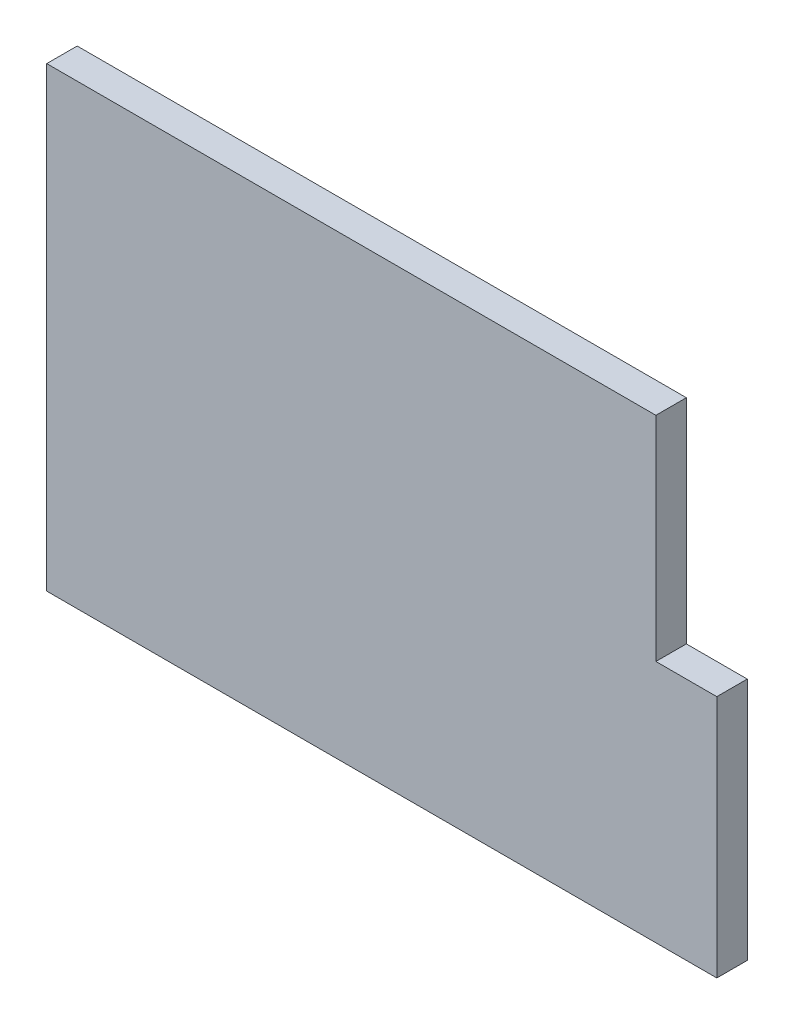
ISO-10303-21;
HEADER;
FILE_DESCRIPTION(('STEP AP214'),'2;1');
FILE_NAME('part.step','',(''),(''),'','','');
FILE_SCHEMA(('AUTOMOTIVE_DESIGN { 1 0 10303 214 1 1 1 1 }'));
ENDSEC;
DATA;
#1=APPLICATION_CONTEXT('core data for automotive mechanical design processes');
#2=APPLICATION_PROTOCOL_DEFINITION('international standard','automotive_design',2000,#1);
#3=PRODUCT_CONTEXT('',#1,'mechanical');
#4=PRODUCT('Part','Part','',(#3));
#5=PRODUCT_RELATED_PRODUCT_CATEGORY('part','',(#4));
#6=PRODUCT_DEFINITION_FORMATION('','',#4);
#7=PRODUCT_DEFINITION_CONTEXT('part definition',#1,'design');
#8=PRODUCT_DEFINITION('design','',#6,#7);
#9=PRODUCT_DEFINITION_SHAPE('','',#8);
#10=(LENGTH_UNIT() NAMED_UNIT(*) SI_UNIT(.MILLI.,.METRE.));
#11=(NAMED_UNIT(*) PLANE_ANGLE_UNIT() SI_UNIT($,.RADIAN.));
#12=(NAMED_UNIT(*) SI_UNIT($,.STERADIAN.) SOLID_ANGLE_UNIT());
#13=UNCERTAINTY_MEASURE_WITH_UNIT(LENGTH_MEASURE(1.E-05),#10,'distance_accuracy_value','');
#14=(GEOMETRIC_REPRESENTATION_CONTEXT(3) GLOBAL_UNCERTAINTY_ASSIGNED_CONTEXT((#13)) GLOBAL_UNIT_ASSIGNED_CONTEXT((#10,
#11,#12)) REPRESENTATION_CONTEXT('',''));
#15=CARTESIAN_POINT('',(0.,0.,0.));
#16=DIRECTION('',(0.,0.,1.));
#17=DIRECTION('',(1.,0.,0.));
#18=AXIS2_PLACEMENT_3D('',#15,#16,#17);
#19=CARTESIAN_POINT('',(10.,0.500000000000002,1.));
#20=DIRECTION('',(-1.,0.,0.));
#21=DIRECTION('',(0.,0.,1.));
#22=AXIS2_PLACEMENT_3D('',#19,#20,#21);
#23=PLANE('',#22);
#24=DIRECTION('',(0.,1.,0.));
#25=VECTOR('',#24,1.);
#26=CARTESIAN_POINT('',(10.,0.500000000000002,0.));
#27=LINE('',#26,#25);
#28=CARTESIAN_POINT('',(10.,0.500000000000002,0.));
#29=VERTEX_POINT('',#28);
#30=CARTESIAN_POINT('',(10.,7.5,0.));
#31=VERTEX_POINT('',#30);
#32=EDGE_CURVE('E116',#29,#31,#27,.T.);
#33=ORIENTED_EDGE('',*,*,#32,.T.);
#34=DIRECTION('',(0.,0.,-1.));
#35=VECTOR('',#34,1.);
#36=CARTESIAN_POINT('',(10.,7.5,1.));
#37=LINE('',#36,#35);
#38=CARTESIAN_POINT('',(10.,7.5,1.));
#39=VERTEX_POINT('',#38);
#40=EDGE_CURVE('E11',#39,#31,#37,.T.);
#41=ORIENTED_EDGE('',*,*,#40,.F.);
#42=DIRECTION('',(0.,1.,0.));
#43=VECTOR('',#42,1.);
#44=CARTESIAN_POINT('',(10.,0.500000000000002,1.));
#45=LINE('',#44,#43);
#46=CARTESIAN_POINT('',(10.,0.500000000000002,1.));
#47=VERTEX_POINT('',#46);
#48=EDGE_CURVE('E127',#47,#39,#45,.T.);
#49=ORIENTED_EDGE('',*,*,#48,.F.);
#50=DIRECTION('',(0.,0.,-1.));
#51=VECTOR('',#50,1.);
#52=CARTESIAN_POINT('',(10.,0.500000000000002,1.));
#53=LINE('',#52,#51);
#54=EDGE_CURVE('E112',#47,#29,#53,.T.);
#55=ORIENTED_EDGE('',*,*,#54,.T.);
#56=EDGE_LOOP('',(#33,#41,#49,#55));
#57=FACE_BOUND('',#56,.T.);
#58=ADVANCED_FACE('F33',(#57),#23,.F.);
#59=CARTESIAN_POINT('',(-10.,7.5,1.));
#60=DIRECTION('',(0.,-1.,0.));
#61=DIRECTION('',(0.,0.,-1.));
#62=AXIS2_PLACEMENT_3D('',#59,#60,#61);
#63=PLANE('',#62);
#64=DIRECTION('',(-1.,0.,0.));
#65=VECTOR('',#64,1.);
#66=CARTESIAN_POINT('',(-10.,7.5,0.));
#67=LINE('',#66,#65);
#68=CARTESIAN_POINT('',(-10.,7.5,0.));
#69=VERTEX_POINT('',#68);
#70=EDGE_CURVE('E119',#31,#69,#67,.T.);
#71=ORIENTED_EDGE('',*,*,#70,.T.);
#72=DIRECTION('',(0.,0.,-1.));
#73=VECTOR('',#72,1.);
#74=CARTESIAN_POINT('',(-10.,7.5,1.));
#75=LINE('',#74,#73);
#76=CARTESIAN_POINT('',(-10.,7.5,1.));
#77=VERTEX_POINT('',#76);
#78=EDGE_CURVE('E41',#77,#69,#75,.T.);
#79=ORIENTED_EDGE('',*,*,#78,.F.);
#80=DIRECTION('',(-1.,0.,0.));
#81=VECTOR('',#80,1.);
#82=CARTESIAN_POINT('',(-10.,7.5,1.));
#83=LINE('',#82,#81);
#84=EDGE_CURVE('E86',#39,#77,#83,.T.);
#85=ORIENTED_EDGE('',*,*,#84,.F.);
#86=ORIENTED_EDGE('',*,*,#40,.T.);
#87=EDGE_LOOP('',(#71,#79,#85,#86));
#88=FACE_BOUND('',#87,.T.);
#89=ADVANCED_FACE('F151',(#88),#63,.F.);
#90=CARTESIAN_POINT('',(-10.,-7.5,1.));
#91=DIRECTION('',(1.,0.,0.));
#92=DIRECTION('',(0.,0.,-1.));
#93=AXIS2_PLACEMENT_3D('',#90,#91,#92);
#94=PLANE('',#93);
#95=DIRECTION('',(0.,-1.,0.));
#96=VECTOR('',#95,1.);
#97=CARTESIAN_POINT('',(-10.,-7.5,0.));
#98=LINE('',#97,#96);
#99=CARTESIAN_POINT('',(-10.,-7.5,0.));
#100=VERTEX_POINT('',#99);
#101=EDGE_CURVE('E121',#69,#100,#98,.T.);
#102=ORIENTED_EDGE('',*,*,#101,.T.);
#103=DIRECTION('',(0.,0.,-1.));
#104=VECTOR('',#103,1.);
#105=CARTESIAN_POINT('',(-10.,-7.5,1.));
#106=LINE('',#105,#104);
#107=CARTESIAN_POINT('',(-10.,-7.5,1.));
#108=VERTEX_POINT('',#107);
#109=EDGE_CURVE('E107',#108,#100,#106,.T.);
#110=ORIENTED_EDGE('',*,*,#109,.F.);
#111=DIRECTION('',(0.,-1.,0.));
#112=VECTOR('',#111,1.);
#113=CARTESIAN_POINT('',(-10.,-7.5,1.));
#114=LINE('',#113,#112);
#115=EDGE_CURVE('E99',#77,#108,#114,.T.);
#116=ORIENTED_EDGE('',*,*,#115,.F.);
#117=ORIENTED_EDGE('',*,*,#78,.T.);
#118=EDGE_LOOP('',(#102,#110,#116,#117));
#119=FACE_BOUND('',#118,.T.);
#120=ADVANCED_FACE('F133',(#119),#94,.F.);
#121=CARTESIAN_POINT('',(10.,-7.5,1.));
#122=DIRECTION('',(0.,1.,0.));
#123=DIRECTION('',(0.,0.,1.));
#124=AXIS2_PLACEMENT_3D('',#121,#122,#123);
#125=PLANE('',#124);
#126=DIRECTION('',(1.,0.,0.));
#127=VECTOR('',#126,1.);
#128=CARTESIAN_POINT('',(10.,-7.5,0.));
#129=LINE('',#128,#127);
#130=CARTESIAN_POINT('',(12.,-7.5,0.));
#131=VERTEX_POINT('',#130);
#132=EDGE_CURVE('E106',#100,#131,#129,.T.);
#133=ORIENTED_EDGE('',*,*,#132,.T.);
#134=DIRECTION('',(0.,0.,-1.));
#135=VECTOR('',#134,1.);
#136=CARTESIAN_POINT('',(12.,-7.5,1.));
#137=LINE('',#136,#135);
#138=CARTESIAN_POINT('',(12.,-7.5,1.));
#139=VERTEX_POINT('',#138);
#140=EDGE_CURVE('E104',#139,#131,#137,.T.);
#141=ORIENTED_EDGE('',*,*,#140,.F.);
#142=DIRECTION('',(1.,0.,0.));
#143=VECTOR('',#142,1.);
#144=CARTESIAN_POINT('',(-10.,-7.5,1.));
#145=LINE('',#144,#143);
#146=EDGE_CURVE('E93',#108,#139,#145,.T.);
#147=ORIENTED_EDGE('',*,*,#146,.F.);
#148=ORIENTED_EDGE('',*,*,#109,.T.);
#149=EDGE_LOOP('',(#133,#141,#147,#148));
#150=FACE_BOUND('',#149,.T.);
#151=ADVANCED_FACE('F105',(#150),#125,.F.);
#152=CARTESIAN_POINT('',(12.,-7.5,1.));
#153=DIRECTION('',(-1.,0.,0.));
#154=DIRECTION('',(0.,0.,1.));
#155=AXIS2_PLACEMENT_3D('',#152,#153,#154);
#156=PLANE('',#155);
#157=DIRECTION('',(0.,1.,0.));
#158=VECTOR('',#157,1.);
#159=CARTESIAN_POINT('',(12.,-7.5,0.));
#160=LINE('',#159,#158);
#161=CARTESIAN_POINT('',(12.,0.500000000000002,0.));
#162=VERTEX_POINT('',#161);
#163=EDGE_CURVE('E72',#131,#162,#160,.T.);
#164=ORIENTED_EDGE('',*,*,#163,.T.);
#165=DIRECTION('',(0.,0.,-1.));
#166=VECTOR('',#165,1.);
#167=CARTESIAN_POINT('',(12.,0.500000000000002,1.));
#168=LINE('',#167,#166);
#169=CARTESIAN_POINT('',(12.,0.500000000000002,1.));
#170=VERTEX_POINT('',#169);
#171=EDGE_CURVE('E108',#170,#162,#168,.T.);
#172=ORIENTED_EDGE('',*,*,#171,.F.);
#173=DIRECTION('',(0.,1.,0.));
#174=VECTOR('',#173,1.);
#175=CARTESIAN_POINT('',(12.,-7.5,1.));
#176=LINE('',#175,#174);
#177=EDGE_CURVE('E97',#139,#170,#176,.T.);
#178=ORIENTED_EDGE('',*,*,#177,.F.);
#179=ORIENTED_EDGE('',*,*,#140,.T.);
#180=EDGE_LOOP('',(#164,#172,#178,#179));
#181=FACE_BOUND('',#180,.T.);
#182=ADVANCED_FACE('F110',(#181),#156,.F.);
#183=CARTESIAN_POINT('',(10.,0.500000000000002,1.));
#184=DIRECTION('',(0.,-1.,0.));
#185=DIRECTION('',(0.,0.,-1.));
#186=AXIS2_PLACEMENT_3D('',#183,#184,#185);
#187=PLANE('',#186);
#188=DIRECTION('',(-1.,0.,0.));
#189=VECTOR('',#188,1.);
#190=CARTESIAN_POINT('',(10.,0.500000000000002,0.));
#191=LINE('',#190,#189);
#192=EDGE_CURVE('E78',#162,#29,#191,.T.);
#193=ORIENTED_EDGE('',*,*,#192,.T.);
#194=ORIENTED_EDGE('',*,*,#54,.F.);
#195=DIRECTION('',(-1.,0.,0.));
#196=VECTOR('',#195,1.);
#197=CARTESIAN_POINT('',(10.,0.500000000000002,1.));
#198=LINE('',#197,#196);
#199=EDGE_CURVE('E49',#170,#47,#198,.T.);
#200=ORIENTED_EDGE('',*,*,#199,.F.);
#201=ORIENTED_EDGE('',*,*,#171,.T.);
#202=EDGE_LOOP('',(#193,#194,#200,#201));
#203=FACE_BOUND('',#202,.T.);
#204=ADVANCED_FACE('F140',(#203),#187,.F.);
#205=CARTESIAN_POINT('',(0.,0.,1.));
#206=DIRECTION('',(0.,0.,-1.));
#207=DIRECTION('',(-1.,0.,0.));
#208=AXIS2_PLACEMENT_3D('',#205,#206,#207);
#209=PLANE('',#208);
#210=ORIENTED_EDGE('',*,*,#48,.T.);
#211=ORIENTED_EDGE('',*,*,#84,.T.);
#212=ORIENTED_EDGE('',*,*,#115,.T.);
#213=ORIENTED_EDGE('',*,*,#146,.T.);
#214=ORIENTED_EDGE('',*,*,#177,.T.);
#215=ORIENTED_EDGE('',*,*,#199,.T.);
#216=EDGE_LOOP('',(#210,#211,#212,#213,#214,#215));
#217=FACE_BOUND('',#216,.T.);
#218=ADVANCED_FACE('F95',(#217),#209,.F.);
#219=CARTESIAN_POINT('',(0.,0.,0.));
#220=DIRECTION('',(0.,0.,-1.));
#221=DIRECTION('',(-1.,0.,0.));
#222=AXIS2_PLACEMENT_3D('',#219,#220,#221);
#223=PLANE('',#222);
#224=ORIENTED_EDGE('',*,*,#32,.F.);
#225=ORIENTED_EDGE('',*,*,#192,.F.);
#226=ORIENTED_EDGE('',*,*,#163,.F.);
#227=ORIENTED_EDGE('',*,*,#132,.F.);
#228=ORIENTED_EDGE('',*,*,#101,.F.);
#229=ORIENTED_EDGE('',*,*,#70,.F.);
#230=EDGE_LOOP('',(#224,#225,#226,#227,#228,#229));
#231=FACE_BOUND('',#230,.T.);
#232=ADVANCED_FACE('F136',(#231),#223,.T.);
#233=CLOSED_SHELL('',(#58,#89,#120,#151,#182,#204,#218,#232));
#234=MANIFOLD_SOLID_BREP('B2',#233);
#235=ADVANCED_BREP_SHAPE_REPRESENTATION('',(#18,#234),#14);
#236=SHAPE_DEFINITION_REPRESENTATION(#9,#235);
ENDSEC;
END-ISO-10303-21;
